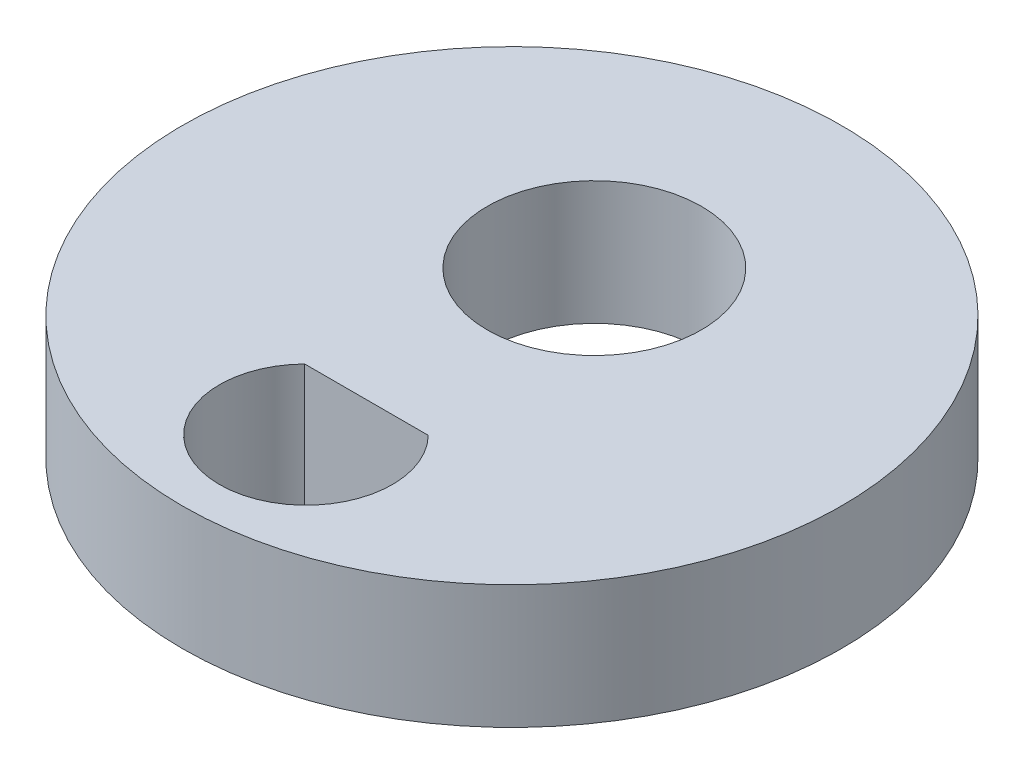
ISO-10303-21;
HEADER;
FILE_DESCRIPTION(('STEP AP214'),'2;1');
FILE_NAME('part.step','',(''),(''),'','','');
FILE_SCHEMA(('AUTOMOTIVE_DESIGN { 1 0 10303 214 1 1 1 1 }'));
ENDSEC;
DATA;
#1=APPLICATION_CONTEXT('core data for automotive mechanical design processes');
#2=APPLICATION_PROTOCOL_DEFINITION('international standard','automotive_design',2000,#1);
#3=PRODUCT_CONTEXT('',#1,'mechanical');
#4=PRODUCT('Part','Part','',(#3));
#5=PRODUCT_RELATED_PRODUCT_CATEGORY('part','',(#4));
#6=PRODUCT_DEFINITION_FORMATION('','',#4);
#7=PRODUCT_DEFINITION_CONTEXT('part definition',#1,'design');
#8=PRODUCT_DEFINITION('design','',#6,#7);
#9=PRODUCT_DEFINITION_SHAPE('','',#8);
#10=(LENGTH_UNIT() NAMED_UNIT(*) SI_UNIT(.MILLI.,.METRE.));
#11=(NAMED_UNIT(*) PLANE_ANGLE_UNIT() SI_UNIT($,.RADIAN.));
#12=(NAMED_UNIT(*) SI_UNIT($,.STERADIAN.) SOLID_ANGLE_UNIT());
#13=UNCERTAINTY_MEASURE_WITH_UNIT(LENGTH_MEASURE(1.E-05),#10,'distance_accuracy_value','');
#14=(GEOMETRIC_REPRESENTATION_CONTEXT(3) GLOBAL_UNCERTAINTY_ASSIGNED_CONTEXT((#13)) GLOBAL_UNIT_ASSIGNED_CONTEXT((#10,
#11,#12)) REPRESENTATION_CONTEXT('',''));
#15=CARTESIAN_POINT('',(0.,0.,0.));
#16=DIRECTION('',(0.,0.,1.));
#17=DIRECTION('',(1.,0.,0.));
#18=AXIS2_PLACEMENT_3D('',#15,#16,#17);
#19=CARTESIAN_POINT('',(0.,3.,0.));
#20=DIRECTION('',(0.,1.,0.));
#21=DIRECTION('',(0.,0.,1.));
#22=AXIS2_PLACEMENT_3D('',#19,#20,#21);
#23=PLANE('',#22);
#24=CARTESIAN_POINT('',(0.,3.,0.));
#25=DIRECTION('',(0.,1.,0.));
#26=DIRECTION('',(0.,0.,1.));
#27=AXIS2_PLACEMENT_3D('',#24,#25,#26);
#28=CIRCLE('',#27,8.);
#29=CARTESIAN_POINT('',(0.,3.,8.));
#30=VERTEX_POINT('',#29);
#31=EDGE_CURVE('E11',#30,#30,#28,.T.);
#32=ORIENTED_EDGE('',*,*,#31,.T.);
#33=EDGE_LOOP('',(#32));
#34=FACE_BOUND('',#33,.T.);
#35=CARTESIAN_POINT('',(0.,3.,-2.));
#36=DIRECTION('',(0.,1.,0.));
#37=DIRECTION('',(0.,0.,1.));
#38=AXIS2_PLACEMENT_3D('',#35,#36,#37);
#39=CIRCLE('',#38,2.6);
#40=CARTESIAN_POINT('',(0.,3.,0.6));
#41=VERTEX_POINT('',#40);
#42=EDGE_CURVE('E96',#41,#41,#39,.T.);
#43=ORIENTED_EDGE('',*,*,#42,.F.);
#44=EDGE_LOOP('',(#43));
#45=FACE_BOUND('',#44,.T.);
#46=DIRECTION('',(-1.,0.,0.));
#47=VECTOR('',#46,1.);
#48=CARTESIAN_POINT('',(1.5,3.,3.53030615433009));
#49=LINE('',#48,#47);
#50=CARTESIAN_POINT('',(1.5,3.,3.53030615433009));
#51=VERTEX_POINT('',#50);
#52=CARTESIAN_POINT('',(-1.5,3.,3.53030615433009));
#53=VERTEX_POINT('',#52);
#54=EDGE_CURVE('E91',#51,#53,#49,.T.);
#55=ORIENTED_EDGE('',*,*,#54,.F.);
#56=CARTESIAN_POINT('',(0.,3.,5.));
#57=DIRECTION('',(0.,1.,0.));
#58=DIRECTION('',(0.,0.,1.));
#59=AXIS2_PLACEMENT_3D('',#56,#57,#58);
#60=CIRCLE('',#59,2.1);
#61=EDGE_CURVE('E79',#53,#51,#60,.T.);
#62=ORIENTED_EDGE('',*,*,#61,.F.);
#63=EDGE_LOOP('',(#55,#62));
#64=FACE_BOUND('',#63,.T.);
#65=ADVANCED_FACE('F45',(#34,#45,#64),#23,.T.);
#66=CARTESIAN_POINT('',(0.,0.,0.));
#67=DIRECTION('',(0.,1.,0.));
#68=DIRECTION('',(0.,0.,1.));
#69=AXIS2_PLACEMENT_3D('',#66,#67,#68);
#70=PLANE('',#69);
#71=CARTESIAN_POINT('',(0.,0.,-2.));
#72=DIRECTION('',(0.,1.,0.));
#73=DIRECTION('',(0.,0.,1.));
#74=AXIS2_PLACEMENT_3D('',#71,#72,#73);
#75=CIRCLE('',#74,2.6);
#76=CARTESIAN_POINT('',(0.,0.,0.6));
#77=VERTEX_POINT('',#76);
#78=EDGE_CURVE('E85',#77,#77,#75,.T.);
#79=ORIENTED_EDGE('',*,*,#78,.T.);
#80=EDGE_LOOP('',(#79));
#81=FACE_BOUND('',#80,.T.);
#82=CARTESIAN_POINT('',(0.,0.,0.));
#83=DIRECTION('',(0.,1.,0.));
#84=DIRECTION('',(0.,0.,1.));
#85=AXIS2_PLACEMENT_3D('',#82,#83,#84);
#86=CIRCLE('',#85,8.);
#87=CARTESIAN_POINT('',(0.,0.,8.));
#88=VERTEX_POINT('',#87);
#89=EDGE_CURVE('E49',#88,#88,#86,.T.);
#90=ORIENTED_EDGE('',*,*,#89,.F.);
#91=EDGE_LOOP('',(#90));
#92=FACE_BOUND('',#91,.T.);
#93=CARTESIAN_POINT('',(0.,0.,5.));
#94=DIRECTION('',(0.,1.,0.));
#95=DIRECTION('',(0.,0.,1.));
#96=AXIS2_PLACEMENT_3D('',#93,#94,#95);
#97=CIRCLE('',#96,2.1);
#98=CARTESIAN_POINT('',(-1.5,0.,3.53030615433009));
#99=VERTEX_POINT('',#98);
#100=CARTESIAN_POINT('',(1.5,0.,3.53030615433009));
#101=VERTEX_POINT('',#100);
#102=EDGE_CURVE('E68',#99,#101,#97,.T.);
#103=ORIENTED_EDGE('',*,*,#102,.T.);
#104=DIRECTION('',(-1.,0.,0.));
#105=VECTOR('',#104,1.);
#106=CARTESIAN_POINT('',(1.5,0.,3.53030615433009));
#107=LINE('',#106,#105);
#108=EDGE_CURVE('E74',#101,#99,#107,.T.);
#109=ORIENTED_EDGE('',*,*,#108,.T.);
#110=EDGE_LOOP('',(#103,#109));
#111=FACE_BOUND('',#110,.T.);
#112=ADVANCED_FACE('F87',(#81,#92,#111),#70,.F.);
#113=CARTESIAN_POINT('',(0.,3.,0.));
#114=DIRECTION('',(0.,-1.,0.));
#115=DIRECTION('',(0.,0.,-1.));
#116=AXIS2_PLACEMENT_3D('',#113,#114,#115);
#117=CYLINDRICAL_SURFACE('',#116,8.);
#118=ORIENTED_EDGE('',*,*,#31,.F.);
#119=EDGE_LOOP('',(#118));
#120=FACE_BOUND('',#119,.T.);
#121=ORIENTED_EDGE('',*,*,#89,.T.);
#122=EDGE_LOOP('',(#121));
#123=FACE_BOUND('',#122,.T.);
#124=ADVANCED_FACE('F47',(#120,#123),#117,.T.);
#125=CARTESIAN_POINT('',(0.,3.,-2.));
#126=DIRECTION('',(0.,-1.,0.));
#127=DIRECTION('',(0.,0.,-1.));
#128=AXIS2_PLACEMENT_3D('',#125,#126,#127);
#129=CYLINDRICAL_SURFACE('',#128,2.6);
#130=ORIENTED_EDGE('',*,*,#42,.T.);
#131=EDGE_LOOP('',(#130));
#132=FACE_BOUND('',#131,.T.);
#133=ORIENTED_EDGE('',*,*,#78,.F.);
#134=EDGE_LOOP('',(#133));
#135=FACE_BOUND('',#134,.T.);
#136=ADVANCED_FACE('F106',(#132,#135),#129,.F.);
#137=CARTESIAN_POINT('',(0.,3.,5.));
#138=DIRECTION('',(0.,-1.,0.));
#139=DIRECTION('',(0.,0.,-1.));
#140=AXIS2_PLACEMENT_3D('',#137,#138,#139);
#141=CYLINDRICAL_SURFACE('',#140,2.1);
#142=ORIENTED_EDGE('',*,*,#102,.F.);
#143=DIRECTION('',(0.,-1.,0.));
#144=VECTOR('',#143,1.);
#145=CARTESIAN_POINT('',(-1.5,3.,3.53030615433009));
#146=LINE('',#145,#144);
#147=EDGE_CURVE('E76',#53,#99,#146,.T.);
#148=ORIENTED_EDGE('',*,*,#147,.F.);
#149=ORIENTED_EDGE('',*,*,#61,.T.);
#150=DIRECTION('',(0.,-1.,0.));
#151=VECTOR('',#150,1.);
#152=CARTESIAN_POINT('',(1.5,3.,3.53030615433009));
#153=LINE('',#152,#151);
#154=EDGE_CURVE('E61',#51,#101,#153,.T.);
#155=ORIENTED_EDGE('',*,*,#154,.T.);
#156=EDGE_LOOP('',(#142,#148,#149,#155));
#157=FACE_BOUND('',#156,.T.);
#158=ADVANCED_FACE('F81',(#157),#141,.F.);
#159=CARTESIAN_POINT('',(1.5,3.,3.53030615433009));
#160=DIRECTION('',(0.,0.,1.));
#161=DIRECTION('',(1.,0.,0.));
#162=AXIS2_PLACEMENT_3D('',#159,#160,#161);
#163=PLANE('',#162);
#164=ORIENTED_EDGE('',*,*,#108,.F.);
#165=ORIENTED_EDGE('',*,*,#154,.F.);
#166=ORIENTED_EDGE('',*,*,#54,.T.);
#167=ORIENTED_EDGE('',*,*,#147,.T.);
#168=EDGE_LOOP('',(#164,#165,#166,#167));
#169=FACE_BOUND('',#168,.T.);
#170=ADVANCED_FACE('F75',(#169),#163,.T.);
#171=CLOSED_SHELL('',(#65,#112,#124,#136,#158,#170));
#172=MANIFOLD_SOLID_BREP('B2',#171);
#173=ADVANCED_BREP_SHAPE_REPRESENTATION('',(#18,#172),#14);
#174=SHAPE_DEFINITION_REPRESENTATION(#9,#173);
ENDSEC;
END-ISO-10303-21;
